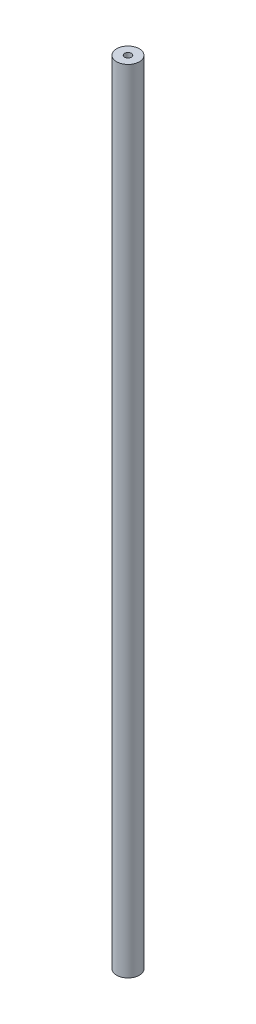
ISO-10303-21;
HEADER;
FILE_DESCRIPTION(('STEP AP214'),'2;1');
FILE_NAME('part.step','',(''),(''),'','','');
FILE_SCHEMA(('AUTOMOTIVE_DESIGN { 1 0 10303 214 1 1 1 1 }'));
ENDSEC;
DATA;
#1=APPLICATION_CONTEXT('core data for automotive mechanical design processes');
#2=APPLICATION_PROTOCOL_DEFINITION('international standard','automotive_design',2000,#1);
#3=PRODUCT_CONTEXT('',#1,'mechanical');
#4=PRODUCT('Part','Part','',(#3));
#5=PRODUCT_RELATED_PRODUCT_CATEGORY('part','',(#4));
#6=PRODUCT_DEFINITION_FORMATION('','',#4);
#7=PRODUCT_DEFINITION_CONTEXT('part definition',#1,'design');
#8=PRODUCT_DEFINITION('design','',#6,#7);
#9=PRODUCT_DEFINITION_SHAPE('','',#8);
#10=(LENGTH_UNIT() NAMED_UNIT(*) SI_UNIT(.MILLI.,.METRE.));
#11=(NAMED_UNIT(*) PLANE_ANGLE_UNIT() SI_UNIT($,.RADIAN.));
#12=(NAMED_UNIT(*) SI_UNIT($,.STERADIAN.) SOLID_ANGLE_UNIT());
#13=UNCERTAINTY_MEASURE_WITH_UNIT(LENGTH_MEASURE(1.E-05),#10,'distance_accuracy_value','');
#14=(GEOMETRIC_REPRESENTATION_CONTEXT(3) GLOBAL_UNCERTAINTY_ASSIGNED_CONTEXT((#13)) GLOBAL_UNIT_ASSIGNED_CONTEXT((#10,
#11,#12)) REPRESENTATION_CONTEXT('',''));
#15=CARTESIAN_POINT('',(0.,0.,0.));
#16=DIRECTION('',(0.,0.,1.));
#17=DIRECTION('',(1.,0.,0.));
#18=AXIS2_PLACEMENT_3D('',#15,#16,#17);
#19=CARTESIAN_POINT('',(0.,350.,0.));
#20=DIRECTION('',(0.,-1.,0.));
#21=DIRECTION('',(0.,0.,-1.));
#22=AXIS2_PLACEMENT_3D('',#19,#20,#21);
#23=CYLINDRICAL_SURFACE('',#22,5.);
#24=CARTESIAN_POINT('',(0.,350.,0.));
#25=DIRECTION('',(0.,1.,0.));
#26=DIRECTION('',(0.,0.,1.));
#27=AXIS2_PLACEMENT_3D('',#24,#25,#26);
#28=CIRCLE('',#27,5.);
#29=CARTESIAN_POINT('',(0.,350.,5.));
#30=VERTEX_POINT('',#29);
#31=EDGE_CURVE('E10',#30,#30,#28,.T.);
#32=ORIENTED_EDGE('',*,*,#31,.F.);
#33=EDGE_LOOP('',(#32));
#34=FACE_BOUND('',#33,.T.);
#35=CARTESIAN_POINT('',(0.,0.,0.));
#36=DIRECTION('',(0.,1.,0.));
#37=DIRECTION('',(0.,0.,1.));
#38=AXIS2_PLACEMENT_3D('',#35,#36,#37);
#39=CIRCLE('',#38,5.);
#40=CARTESIAN_POINT('',(0.,0.,5.));
#41=VERTEX_POINT('',#40);
#42=EDGE_CURVE('E34',#41,#41,#39,.T.);
#43=ORIENTED_EDGE('',*,*,#42,.T.);
#44=EDGE_LOOP('',(#43));
#45=FACE_BOUND('',#44,.T.);
#46=ADVANCED_FACE('F31',(#34,#45),#23,.T.);
#47=CARTESIAN_POINT('',(0.,350.,0.));
#48=DIRECTION('',(0.,1.,0.));
#49=DIRECTION('',(0.,0.,1.));
#50=AXIS2_PLACEMENT_3D('',#47,#48,#49);
#51=PLANE('',#50);
#52=CARTESIAN_POINT('',(0.,350.,0.));
#53=DIRECTION('',(0.,1.,0.));
#54=DIRECTION('',(0.,0.,1.));
#55=AXIS2_PLACEMENT_3D('',#52,#53,#54);
#56=CIRCLE('',#55,1.5);
#57=CARTESIAN_POINT('',(0.,350.,1.5));
#58=VERTEX_POINT('',#57);
#59=EDGE_CURVE('E43',#58,#58,#56,.T.);
#60=ORIENTED_EDGE('',*,*,#59,.F.);
#61=EDGE_LOOP('',(#60));
#62=FACE_BOUND('',#61,.T.);
#63=ORIENTED_EDGE('',*,*,#31,.T.);
#64=EDGE_LOOP('',(#63));
#65=FACE_BOUND('',#64,.T.);
#66=ADVANCED_FACE('F58',(#62,#65),#51,.T.);
#67=CARTESIAN_POINT('',(0.,0.,0.));
#68=DIRECTION('',(0.,1.,0.));
#69=DIRECTION('',(0.,0.,1.));
#70=AXIS2_PLACEMENT_3D('',#67,#68,#69);
#71=PLANE('',#70);
#72=ORIENTED_EDGE('',*,*,#42,.F.);
#73=EDGE_LOOP('',(#72));
#74=FACE_BOUND('',#73,.T.);
#75=ADVANCED_FACE('F54',(#74),#71,.F.);
#76=CARTESIAN_POINT('',(0.,340.,0.));
#77=DIRECTION('',(0.,1.,0.));
#78=DIRECTION('',(0.,0.,1.));
#79=AXIS2_PLACEMENT_3D('',#76,#77,#78);
#80=CYLINDRICAL_SURFACE('',#79,1.5);
#81=CARTESIAN_POINT('',(0.,340.,0.));
#82=DIRECTION('',(0.,1.,0.));
#83=DIRECTION('',(0.,0.,1.));
#84=AXIS2_PLACEMENT_3D('',#81,#82,#83);
#85=CIRCLE('',#84,1.5);
#86=CARTESIAN_POINT('',(0.,340.,1.5));
#87=VERTEX_POINT('',#86);
#88=EDGE_CURVE('E41',#87,#87,#85,.T.);
#89=ORIENTED_EDGE('',*,*,#88,.F.);
#90=EDGE_LOOP('',(#89));
#91=FACE_BOUND('',#90,.T.);
#92=ORIENTED_EDGE('',*,*,#59,.T.);
#93=EDGE_LOOP('',(#92));
#94=FACE_BOUND('',#93,.T.);
#95=ADVANCED_FACE('F51',(#91,#94),#80,.F.);
#96=CARTESIAN_POINT('',(0.,340.,0.));
#97=DIRECTION('',(0.,1.,0.));
#98=DIRECTION('',(0.,0.,1.));
#99=AXIS2_PLACEMENT_3D('',#96,#97,#98);
#100=PLANE('',#99);
#101=ORIENTED_EDGE('',*,*,#88,.T.);
#102=EDGE_LOOP('',(#101));
#103=FACE_BOUND('',#102,.T.);
#104=ADVANCED_FACE('F49',(#103),#100,.T.);
#105=CLOSED_SHELL('',(#46,#66,#75,#95,#104));
#106=MANIFOLD_SOLID_BREP('B2',#105);
#107=ADVANCED_BREP_SHAPE_REPRESENTATION('',(#18,#106),#14);
#108=SHAPE_DEFINITION_REPRESENTATION(#9,#107);
ENDSEC;
END-ISO-10303-21;
